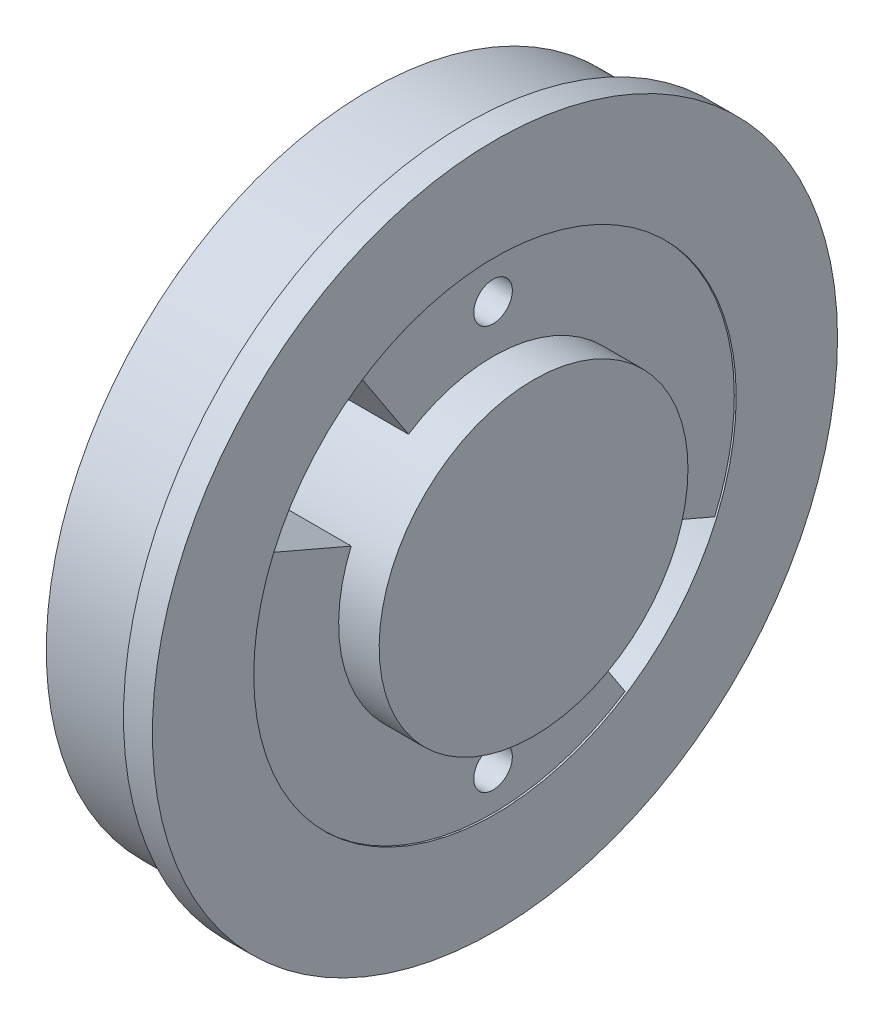
ISO-10303-21;
HEADER;
FILE_DESCRIPTION(('STEP AP214'),'2;1');
FILE_NAME('part.step','',(''),(''),'','','');
FILE_SCHEMA(('AUTOMOTIVE_DESIGN { 1 0 10303 214 1 1 1 1 }'));
ENDSEC;
DATA;
#1=APPLICATION_CONTEXT('core data for automotive mechanical design processes');
#2=APPLICATION_PROTOCOL_DEFINITION('international standard','automotive_design',2000,#1);
#3=PRODUCT_CONTEXT('',#1,'mechanical');
#4=PRODUCT('Part','Part','',(#3));
#5=PRODUCT_RELATED_PRODUCT_CATEGORY('part','',(#4));
#6=PRODUCT_DEFINITION_FORMATION('','',#4);
#7=PRODUCT_DEFINITION_CONTEXT('part definition',#1,'design');
#8=PRODUCT_DEFINITION('design','',#6,#7);
#9=PRODUCT_DEFINITION_SHAPE('','',#8);
#10=(LENGTH_UNIT() NAMED_UNIT(*) SI_UNIT(.MILLI.,.METRE.));
#11=(NAMED_UNIT(*) PLANE_ANGLE_UNIT() SI_UNIT($,.RADIAN.));
#12=(NAMED_UNIT(*) SI_UNIT($,.STERADIAN.) SOLID_ANGLE_UNIT());
#13=UNCERTAINTY_MEASURE_WITH_UNIT(LENGTH_MEASURE(1.E-05),#10,'distance_accuracy_value','');
#14=(GEOMETRIC_REPRESENTATION_CONTEXT(3) GLOBAL_UNCERTAINTY_ASSIGNED_CONTEXT((#13)) GLOBAL_UNIT_ASSIGNED_CONTEXT((#10,
#11,#12)) REPRESENTATION_CONTEXT('',''));
#15=CARTESIAN_POINT('',(0.,0.,0.));
#16=DIRECTION('',(0.,0.,1.));
#17=DIRECTION('',(1.,0.,0.));
#18=AXIS2_PLACEMENT_3D('',#15,#16,#17);
#19=CARTESIAN_POINT('',(6.4,0.,0.));
#20=DIRECTION('',(1.,0.,0.));
#21=DIRECTION('',(0.,0.,-1.));
#22=AXIS2_PLACEMENT_3D('',#19,#20,#21);
#23=CYLINDRICAL_SURFACE('',#22,12.5);
#24=CARTESIAN_POINT('',(6.5,0.,0.));
#25=DIRECTION('',(1.,0.,0.));
#26=DIRECTION('',(0.,0.,-1.));
#27=AXIS2_PLACEMENT_3D('',#24,#25,#26);
#28=CIRCLE('',#27,12.5);
#29=CARTESIAN_POINT('',(6.5,0.,-12.5));
#30=VERTEX_POINT('',#29);
#31=EDGE_CURVE('E150',#30,#30,#28,.T.);
#32=ORIENTED_EDGE('',*,*,#31,.T.);
#33=EDGE_LOOP('',(#32));
#34=FACE_BOUND('',#33,.T.);
#35=CARTESIAN_POINT('',(3.,0.,0.));
#36=DIRECTION('',(-1.,0.,0.));
#37=DIRECTION('',(0.,0.,1.));
#38=AXIS2_PLACEMENT_3D('',#35,#36,#37);
#39=CIRCLE('',#38,12.5);
#40=CARTESIAN_POINT('',(3.,-10.4595444077961,-6.84455482711202));
#41=VERTEX_POINT('',#40);
#42=CARTESIAN_POINT('',(3.,-4.94033364551587,-11.4822952178989));
#43=VERTEX_POINT('',#42);
#44=EDGE_CURVE('E99',#41,#43,#39,.F.);
#45=ORIENTED_EDGE('',*,*,#44,.F.);
#46=DIRECTION('',(1.,0.,0.));
#47=VECTOR('',#46,1.);
#48=CARTESIAN_POINT('',(-21.6,-10.4595444077961,-6.84455482711201));
#49=LINE('',#48,#47);
#50=CARTESIAN_POINT('',(6.4,-10.4595444077961,-6.84455482711201));
#51=VERTEX_POINT('',#50);
#52=EDGE_CURVE('E109',#41,#51,#49,.T.);
#53=ORIENTED_EDGE('',*,*,#52,.T.);
#54=CARTESIAN_POINT('',(6.4,0.,0.));
#55=DIRECTION('',(1.,0.,0.));
#56=DIRECTION('',(0.,0.,-1.));
#57=AXIS2_PLACEMENT_3D('',#54,#55,#56);
#58=CIRCLE('',#57,12.5);
#59=CARTESIAN_POINT('',(6.4,4.94033364551587,11.4822952178989));
#60=VERTEX_POINT('',#59);
#61=EDGE_CURVE('E151',#60,#51,#58,.T.);
#62=ORIENTED_EDGE('',*,*,#61,.F.);
#63=DIRECTION('',(1.,0.,0.));
#64=VECTOR('',#63,1.);
#65=CARTESIAN_POINT('',(-21.6,4.94033364551587,11.4822952178989));
#66=LINE('',#65,#64);
#67=CARTESIAN_POINT('',(3.,4.94033364551587,11.4822952178989));
#68=VERTEX_POINT('',#67);
#69=EDGE_CURVE('E136',#68,#60,#66,.T.);
#70=ORIENTED_EDGE('',*,*,#69,.F.);
#71=CARTESIAN_POINT('',(3.,10.459544407796,6.84455482711202));
#72=VERTEX_POINT('',#71);
#73=EDGE_CURVE('E115',#72,#68,#39,.F.);
#74=ORIENTED_EDGE('',*,*,#73,.F.);
#75=DIRECTION('',(1.,0.,0.));
#76=VECTOR('',#75,1.);
#77=CARTESIAN_POINT('',(-21.6,10.459544407796,6.84455482711202));
#78=LINE('',#77,#76);
#79=CARTESIAN_POINT('',(6.4,10.459544407796,6.84455482711202));
#80=VERTEX_POINT('',#79);
#81=EDGE_CURVE('E138',#72,#80,#78,.T.);
#82=ORIENTED_EDGE('',*,*,#81,.T.);
#83=CARTESIAN_POINT('',(6.4,-4.94033364551587,-11.4822952178989));
#84=VERTEX_POINT('',#83);
#85=EDGE_CURVE('E154',#84,#80,#58,.T.);
#86=ORIENTED_EDGE('',*,*,#85,.F.);
#87=DIRECTION('',(1.,0.,0.));
#88=VECTOR('',#87,1.);
#89=CARTESIAN_POINT('',(-21.6,-4.94033364551587,-11.4822952178989));
#90=LINE('',#89,#88);
#91=EDGE_CURVE('E112',#43,#84,#90,.T.);
#92=ORIENTED_EDGE('',*,*,#91,.F.);
#93=EDGE_LOOP('',(#45,#53,#62,#70,#74,#82,#86,#92));
#94=FACE_BOUND('',#93,.T.);
#95=ADVANCED_FACE('F31',(#34,#94),#23,.F.);
#96=CARTESIAN_POINT('',(8.5,0.,0.));
#97=DIRECTION('',(-1.,0.,0.));
#98=DIRECTION('',(0.,0.,1.));
#99=AXIS2_PLACEMENT_3D('',#96,#97,#98);
#100=CYLINDRICAL_SURFACE('',#99,8.);
#101=CARTESIAN_POINT('',(8.5,0.,0.));
#102=DIRECTION('',(1.,0.,0.));
#103=DIRECTION('',(0.,0.,-1.));
#104=AXIS2_PLACEMENT_3D('',#101,#102,#103);
#105=CIRCLE('',#104,8.);
#106=CARTESIAN_POINT('',(8.5,0.,-8.));
#107=VERTEX_POINT('',#106);
#108=EDGE_CURVE('E153',#107,#107,#105,.T.);
#109=ORIENTED_EDGE('',*,*,#108,.F.);
#110=EDGE_LOOP('',(#109));
#111=FACE_BOUND('',#110,.T.);
#112=CARTESIAN_POINT('',(3.,0.,0.));
#113=DIRECTION('',(-1.,0.,0.));
#114=DIRECTION('',(0.,0.,1.));
#115=AXIS2_PLACEMENT_3D('',#112,#113,#114);
#116=CIRCLE('',#115,8.);
#117=CARTESIAN_POINT('',(3.,3.16181353313016,7.34866893945529));
#118=VERTEX_POINT('',#117);
#119=CARTESIAN_POINT('',(3.,6.69410842098947,4.38051508935169));
#120=VERTEX_POINT('',#119);
#121=EDGE_CURVE('E48',#118,#120,#116,.T.);
#122=ORIENTED_EDGE('',*,*,#121,.F.);
#123=DIRECTION('',(1.,0.,0.));
#124=VECTOR('',#123,1.);
#125=CARTESIAN_POINT('',(-21.6,3.16181353313016,7.34866893945529));
#126=LINE('',#125,#124);
#127=CARTESIAN_POINT('',(6.4,3.16181353313016,7.34866893945529));
#128=VERTEX_POINT('',#127);
#129=EDGE_CURVE('E133',#118,#128,#126,.T.);
#130=ORIENTED_EDGE('',*,*,#129,.T.);
#131=CARTESIAN_POINT('',(6.4,0.,0.));
#132=DIRECTION('',(1.,0.,0.));
#133=DIRECTION('',(0.,0.,-1.));
#134=AXIS2_PLACEMENT_3D('',#131,#132,#133);
#135=CIRCLE('',#134,8.);
#136=CARTESIAN_POINT('',(6.4,-6.69410842098947,-4.38051508935169));
#137=VERTEX_POINT('',#136);
#138=EDGE_CURVE('E147',#128,#137,#135,.T.);
#139=ORIENTED_EDGE('',*,*,#138,.T.);
#140=DIRECTION('',(1.,0.,0.));
#141=VECTOR('',#140,1.);
#142=CARTESIAN_POINT('',(-21.6,-6.69410842098947,-4.38051508935169));
#143=LINE('',#142,#141);
#144=CARTESIAN_POINT('',(3.,-6.69410842098947,-4.38051508935169));
#145=VERTEX_POINT('',#144);
#146=EDGE_CURVE('E120',#145,#137,#143,.T.);
#147=ORIENTED_EDGE('',*,*,#146,.F.);
#148=CARTESIAN_POINT('',(3.,-3.16181353313016,-7.34866893945529));
#149=VERTEX_POINT('',#148);
#150=EDGE_CURVE('E56',#149,#145,#116,.T.);
#151=ORIENTED_EDGE('',*,*,#150,.F.);
#152=DIRECTION('',(1.,0.,0.));
#153=VECTOR('',#152,1.);
#154=CARTESIAN_POINT('',(-21.6,-3.16181353313016,-7.34866893945529));
#155=LINE('',#154,#153);
#156=CARTESIAN_POINT('',(6.4,-3.16181353313016,-7.34866893945529));
#157=VERTEX_POINT('',#156);
#158=EDGE_CURVE('E122',#149,#157,#155,.T.);
#159=ORIENTED_EDGE('',*,*,#158,.T.);
#160=CARTESIAN_POINT('',(6.4,6.69410842098947,4.38051508935169));
#161=VERTEX_POINT('',#160);
#162=EDGE_CURVE('E146',#157,#161,#135,.T.);
#163=ORIENTED_EDGE('',*,*,#162,.T.);
#164=DIRECTION('',(1.,0.,0.));
#165=VECTOR('',#164,1.);
#166=CARTESIAN_POINT('',(-21.6,6.69410842098947,4.38051508935169));
#167=LINE('',#166,#165);
#168=EDGE_CURVE('E132',#120,#161,#167,.T.);
#169=ORIENTED_EDGE('',*,*,#168,.F.);
#170=EDGE_LOOP('',(#122,#130,#139,#147,#151,#159,#163,#169));
#171=FACE_BOUND('',#170,.T.);
#172=ADVANCED_FACE('F181',(#111,#171),#100,.T.);
#173=CARTESIAN_POINT('',(-21.6,4.94033364551587,11.4822952178989));
#174=DIRECTION('',(0.,-0.918583617431912,0.39522669164127));
#175=DIRECTION('',(0.,-0.39522669164127,-0.918583617431912));
#176=AXIS2_PLACEMENT_3D('',#173,#174,#175);
#177=PLANE('',#176);
#178=DIRECTION('',(0.,-0.39522669164127,-0.918583617431912));
#179=VECTOR('',#178,1.);
#180=CARTESIAN_POINT('',(3.,4.94033364551587,11.4822952178989));
#181=LINE('',#180,#179);
#182=EDGE_CURVE('E168',#68,#118,#181,.T.);
#183=ORIENTED_EDGE('',*,*,#182,.F.);
#184=ORIENTED_EDGE('',*,*,#69,.T.);
#185=DIRECTION('',(0.,-0.39522669164127,-0.918583617431912));
#186=VECTOR('',#185,1.);
#187=CARTESIAN_POINT('',(6.4,0.,0.));
#188=LINE('',#187,#186);
#189=EDGE_CURVE('E143',#60,#128,#188,.T.);
#190=ORIENTED_EDGE('',*,*,#189,.T.);
#191=ORIENTED_EDGE('',*,*,#129,.F.);
#192=EDGE_LOOP('',(#183,#184,#190,#191));
#193=FACE_BOUND('',#192,.T.);
#194=ADVANCED_FACE('F197',(#193),#177,.F.);
#195=CARTESIAN_POINT('',(-21.6,6.69410842098947,4.38051508935169));
#196=DIRECTION('',(0.,0.547564386168961,-0.836763552623684));
#197=DIRECTION('',(0.,0.836763552623684,0.547564386168961));
#198=AXIS2_PLACEMENT_3D('',#195,#196,#197);
#199=PLANE('',#198);
#200=DIRECTION('',(0.,0.836763552623684,0.547564386168961));
#201=VECTOR('',#200,1.);
#202=CARTESIAN_POINT('',(3.,6.69410842098947,4.38051508935169));
#203=LINE('',#202,#201);
#204=EDGE_CURVE('E176',#120,#72,#203,.T.);
#205=ORIENTED_EDGE('',*,*,#204,.F.);
#206=ORIENTED_EDGE('',*,*,#168,.T.);
#207=DIRECTION('',(0.,0.836763552623684,0.547564386168961));
#208=VECTOR('',#207,1.);
#209=CARTESIAN_POINT('',(6.4,0.,0.));
#210=LINE('',#209,#208);
#211=EDGE_CURVE('E135',#161,#80,#210,.T.);
#212=ORIENTED_EDGE('',*,*,#211,.T.);
#213=ORIENTED_EDGE('',*,*,#81,.F.);
#214=EDGE_LOOP('',(#205,#206,#212,#213));
#215=FACE_BOUND('',#214,.T.);
#216=ADVANCED_FACE('F193',(#215),#199,.F.);
#217=CARTESIAN_POINT('',(-21.6,-3.16181353313016,-7.34866893945529));
#218=DIRECTION('',(0.,0.918583617431912,-0.39522669164127));
#219=DIRECTION('',(0.,0.39522669164127,0.918583617431912));
#220=AXIS2_PLACEMENT_3D('',#217,#218,#219);
#221=PLANE('',#220);
#222=DIRECTION('',(0.,0.39522669164127,0.918583617431912));
#223=VECTOR('',#222,1.);
#224=CARTESIAN_POINT('',(3.,-3.16181353313016,-7.34866893945529));
#225=LINE('',#224,#223);
#226=EDGE_CURVE('E113',#43,#149,#225,.T.);
#227=ORIENTED_EDGE('',*,*,#226,.F.);
#228=ORIENTED_EDGE('',*,*,#91,.T.);
#229=DIRECTION('',(0.,0.39522669164127,0.918583617431912));
#230=VECTOR('',#229,1.);
#231=CARTESIAN_POINT('',(6.4,0.,0.));
#232=LINE('',#231,#230);
#233=EDGE_CURVE('E129',#84,#157,#232,.T.);
#234=ORIENTED_EDGE('',*,*,#233,.T.);
#235=ORIENTED_EDGE('',*,*,#158,.F.);
#236=EDGE_LOOP('',(#227,#228,#234,#235));
#237=FACE_BOUND('',#236,.T.);
#238=ADVANCED_FACE('F187',(#237),#221,.F.);
#239=CARTESIAN_POINT('',(-21.6,-10.459544407796,-6.84455482711202));
#240=DIRECTION('',(0.,-0.547564386168962,0.836763552623684));
#241=DIRECTION('',(0.,-0.836763552623684,-0.547564386168962));
#242=AXIS2_PLACEMENT_3D('',#239,#240,#241);
#243=PLANE('',#242);
#244=DIRECTION('',(0.,-0.836763552623684,-0.547564386168962));
#245=VECTOR('',#244,1.);
#246=CARTESIAN_POINT('',(3.,-10.459544407796,-6.84455482711202));
#247=LINE('',#246,#245);
#248=EDGE_CURVE('E95',#145,#41,#247,.T.);
#249=ORIENTED_EDGE('',*,*,#248,.F.);
#250=ORIENTED_EDGE('',*,*,#146,.T.);
#251=DIRECTION('',(0.,-0.836763552623684,-0.547564386168962));
#252=VECTOR('',#251,1.);
#253=CARTESIAN_POINT('',(6.4,0.,0.));
#254=LINE('',#253,#252);
#255=EDGE_CURVE('E118',#137,#51,#254,.T.);
#256=ORIENTED_EDGE('',*,*,#255,.T.);
#257=ORIENTED_EDGE('',*,*,#52,.F.);
#258=EDGE_LOOP('',(#249,#250,#256,#257));
#259=FACE_BOUND('',#258,.T.);
#260=ADVANCED_FACE('F116',(#259),#243,.F.);
#261=CARTESIAN_POINT('',(-21.6,10.459544407796,0.));
#262=DIRECTION('',(1.,0.,0.));
#263=DIRECTION('',(0.,0.,-1.));
#264=AXIS2_PLACEMENT_3D('',#261,#262,#263);
#265=CYLINDRICAL_SURFACE('',#264,1.);
#266=CARTESIAN_POINT('',(6.4,10.459544407796,0.));
#267=DIRECTION('',(1.,0.,0.));
#268=DIRECTION('',(0.,0.,-1.));
#269=AXIS2_PLACEMENT_3D('',#266,#267,#268);
#270=CIRCLE('',#269,1.);
#271=CARTESIAN_POINT('',(6.4,10.459544407796,-1.));
#272=VERTEX_POINT('',#271);
#273=EDGE_CURVE('E124',#272,#272,#270,.T.);
#274=ORIENTED_EDGE('',*,*,#273,.T.);
#275=EDGE_LOOP('',(#274));
#276=FACE_BOUND('',#275,.T.);
#277=CARTESIAN_POINT('',(3.,10.459544407796,0.));
#278=DIRECTION('',(-1.,0.,0.));
#279=DIRECTION('',(0.,0.,1.));
#280=AXIS2_PLACEMENT_3D('',#277,#278,#279);
#281=CIRCLE('',#280,1.);
#282=CARTESIAN_POINT('',(3.,10.459544407796,1.));
#283=VERTEX_POINT('',#282);
#284=EDGE_CURVE('E104',#283,#283,#281,.F.);
#285=ORIENTED_EDGE('',*,*,#284,.F.);
#286=EDGE_LOOP('',(#285));
#287=FACE_BOUND('',#286,.T.);
#288=ADVANCED_FACE('F219',(#276,#287),#265,.F.);
#289=CARTESIAN_POINT('',(-21.6,-10.459544407796,0.));
#290=DIRECTION('',(1.,0.,0.));
#291=DIRECTION('',(0.,0.,-1.));
#292=AXIS2_PLACEMENT_3D('',#289,#290,#291);
#293=CYLINDRICAL_SURFACE('',#292,1.);
#294=CARTESIAN_POINT('',(6.4,-10.459544407796,0.));
#295=DIRECTION('',(1.,0.,0.));
#296=DIRECTION('',(0.,0.,-1.));
#297=AXIS2_PLACEMENT_3D('',#294,#295,#296);
#298=CIRCLE('',#297,1.);
#299=CARTESIAN_POINT('',(6.4,-10.459544407796,-1.));
#300=VERTEX_POINT('',#299);
#301=EDGE_CURVE('E166',#300,#300,#298,.T.);
#302=ORIENTED_EDGE('',*,*,#301,.T.);
#303=EDGE_LOOP('',(#302));
#304=FACE_BOUND('',#303,.T.);
#305=CARTESIAN_POINT('',(3.,-10.459544407796,0.));
#306=DIRECTION('',(-1.,0.,0.));
#307=DIRECTION('',(0.,0.,1.));
#308=AXIS2_PLACEMENT_3D('',#305,#306,#307);
#309=CIRCLE('',#308,1.);
#310=CARTESIAN_POINT('',(3.,-10.459544407796,1.));
#311=VERTEX_POINT('',#310);
#312=EDGE_CURVE('E35',#311,#311,#309,.F.);
#313=ORIENTED_EDGE('',*,*,#312,.F.);
#314=EDGE_LOOP('',(#313));
#315=FACE_BOUND('',#314,.T.);
#316=ADVANCED_FACE('F217',(#304,#315),#293,.F.);
#317=CARTESIAN_POINT('',(6.4,0.,0.));
#318=DIRECTION('',(1.,0.,0.));
#319=DIRECTION('',(0.,0.,-1.));
#320=AXIS2_PLACEMENT_3D('',#317,#318,#319);
#321=PLANE('',#320);
#322=ORIENTED_EDGE('',*,*,#273,.F.);
#323=EDGE_LOOP('',(#322));
#324=FACE_BOUND('',#323,.T.);
#325=ORIENTED_EDGE('',*,*,#233,.F.);
#326=ORIENTED_EDGE('',*,*,#85,.T.);
#327=ORIENTED_EDGE('',*,*,#211,.F.);
#328=ORIENTED_EDGE('',*,*,#162,.F.);
#329=EDGE_LOOP('',(#325,#326,#327,#328));
#330=FACE_BOUND('',#329,.T.);
#331=ADVANCED_FACE('F190',(#324,#330),#321,.T.);
#332=CARTESIAN_POINT('',(6.5,0.,0.));
#333=DIRECTION('',(1.,0.,0.));
#334=DIRECTION('',(0.,0.,-1.));
#335=AXIS2_PLACEMENT_3D('',#332,#333,#334);
#336=PLANE('',#335);
#337=ORIENTED_EDGE('',*,*,#31,.F.);
#338=EDGE_LOOP('',(#337));
#339=FACE_BOUND('',#338,.T.);
#340=CARTESIAN_POINT('',(6.5,0.,0.));
#341=DIRECTION('',(1.,0.,0.));
#342=DIRECTION('',(0.,0.,-1.));
#343=AXIS2_PLACEMENT_3D('',#340,#341,#342);
#344=CIRCLE('',#343,17.75);
#345=CARTESIAN_POINT('',(6.5,0.,-17.75));
#346=VERTEX_POINT('',#345);
#347=EDGE_CURVE('E160',#346,#346,#344,.T.);
#348=ORIENTED_EDGE('',*,*,#347,.T.);
#349=EDGE_LOOP('',(#348));
#350=FACE_BOUND('',#349,.T.);
#351=ADVANCED_FACE('F225',(#339,#350),#336,.T.);
#352=CARTESIAN_POINT('',(5.,0.,0.));
#353=DIRECTION('',(-1.,0.,0.));
#354=DIRECTION('',(0.,0.,1.));
#355=AXIS2_PLACEMENT_3D('',#352,#353,#354);
#356=CYLINDRICAL_SURFACE('',#355,16.75);
#357=CARTESIAN_POINT('',(5.,0.,0.));
#358=DIRECTION('',(1.,0.,0.));
#359=DIRECTION('',(0.,0.,-1.));
#360=AXIS2_PLACEMENT_3D('',#357,#358,#359);
#361=CIRCLE('',#360,16.75);
#362=CARTESIAN_POINT('',(5.,0.,-16.75));
#363=VERTEX_POINT('',#362);
#364=EDGE_CURVE('E11',#363,#363,#361,.T.);
#365=ORIENTED_EDGE('',*,*,#364,.F.);
#366=EDGE_LOOP('',(#365));
#367=FACE_BOUND('',#366,.T.);
#368=CARTESIAN_POINT('',(0.,0.,0.));
#369=DIRECTION('',(1.,0.,0.));
#370=DIRECTION('',(0.,0.,-1.));
#371=AXIS2_PLACEMENT_3D('',#368,#369,#370);
#372=CIRCLE('',#371,16.75);
#373=CARTESIAN_POINT('',(0.,0.,-16.75));
#374=VERTEX_POINT('',#373);
#375=EDGE_CURVE('E40',#374,#374,#372,.T.);
#376=ORIENTED_EDGE('',*,*,#375,.T.);
#377=EDGE_LOOP('',(#376));
#378=FACE_BOUND('',#377,.T.);
#379=ADVANCED_FACE('F33',(#367,#378),#356,.T.);
#380=CARTESIAN_POINT('',(0.,0.,0.));
#381=DIRECTION('',(1.,0.,0.));
#382=DIRECTION('',(0.,0.,-1.));
#383=AXIS2_PLACEMENT_3D('',#380,#381,#382);
#384=PLANE('',#383);
#385=CARTESIAN_POINT('',(0.,0.,0.));
#386=DIRECTION('',(-1.,0.,0.));
#387=DIRECTION('',(0.,0.,1.));
#388=AXIS2_PLACEMENT_3D('',#385,#386,#387);
#389=CIRCLE('',#388,14.75);
#390=CARTESIAN_POINT('',(0.,0.,14.75));
#391=VERTEX_POINT('',#390);
#392=EDGE_CURVE('E207',#391,#391,#389,.T.);
#393=ORIENTED_EDGE('',*,*,#392,.F.);
#394=EDGE_LOOP('',(#393));
#395=FACE_BOUND('',#394,.T.);
#396=ORIENTED_EDGE('',*,*,#375,.F.);
#397=EDGE_LOOP('',(#396));
#398=FACE_BOUND('',#397,.T.);
#399=ADVANCED_FACE('F252',(#395,#398),#384,.F.);
#400=CARTESIAN_POINT('',(5.,0.,0.));
#401=DIRECTION('',(1.,0.,0.));
#402=DIRECTION('',(0.,0.,-1.));
#403=AXIS2_PLACEMENT_3D('',#400,#401,#402);
#404=PLANE('',#403);
#405=CARTESIAN_POINT('',(5.,0.,0.));
#406=DIRECTION('',(1.,0.,0.));
#407=DIRECTION('',(0.,0.,-1.));
#408=AXIS2_PLACEMENT_3D('',#405,#406,#407);
#409=CIRCLE('',#408,17.75);
#410=CARTESIAN_POINT('',(5.,0.,-17.75));
#411=VERTEX_POINT('',#410);
#412=EDGE_CURVE('E159',#411,#411,#409,.T.);
#413=ORIENTED_EDGE('',*,*,#412,.F.);
#414=EDGE_LOOP('',(#413));
#415=FACE_BOUND('',#414,.T.);
#416=ORIENTED_EDGE('',*,*,#364,.T.);
#417=EDGE_LOOP('',(#416));
#418=FACE_BOUND('',#417,.T.);
#419=ADVANCED_FACE('F248',(#415,#418),#404,.F.);
#420=CARTESIAN_POINT('',(6.5,0.,0.));
#421=DIRECTION('',(-1.,0.,0.));
#422=DIRECTION('',(0.,0.,1.));
#423=AXIS2_PLACEMENT_3D('',#420,#421,#422);
#424=CYLINDRICAL_SURFACE('',#423,17.75);
#425=ORIENTED_EDGE('',*,*,#347,.F.);
#426=EDGE_LOOP('',(#425));
#427=FACE_BOUND('',#426,.T.);
#428=ORIENTED_EDGE('',*,*,#412,.T.);
#429=EDGE_LOOP('',(#428));
#430=FACE_BOUND('',#429,.T.);
#431=ADVANCED_FACE('F251',(#427,#430),#424,.T.);
#432=ORIENTED_EDGE('',*,*,#301,.F.);
#433=EDGE_LOOP('',(#432));
#434=FACE_BOUND('',#433,.T.);
#435=ORIENTED_EDGE('',*,*,#255,.F.);
#436=ORIENTED_EDGE('',*,*,#138,.F.);
#437=ORIENTED_EDGE('',*,*,#189,.F.);
#438=ORIENTED_EDGE('',*,*,#61,.T.);
#439=EDGE_LOOP('',(#435,#436,#437,#438));
#440=FACE_BOUND('',#439,.T.);
#441=ADVANCED_FACE('F202',(#434,#440),#321,.T.);
#442=CARTESIAN_POINT('',(8.5,0.,0.));
#443=DIRECTION('',(1.,0.,0.));
#444=DIRECTION('',(0.,0.,-1.));
#445=AXIS2_PLACEMENT_3D('',#442,#443,#444);
#446=PLANE('',#445);
#447=ORIENTED_EDGE('',*,*,#108,.T.);
#448=EDGE_LOOP('',(#447));
#449=FACE_BOUND('',#448,.T.);
#450=ADVANCED_FACE('F241',(#449),#446,.T.);
#451=CARTESIAN_POINT('',(3.,0.,0.));
#452=DIRECTION('',(-1.,0.,0.));
#453=DIRECTION('',(0.,0.,1.));
#454=AXIS2_PLACEMENT_3D('',#451,#452,#453);
#455=PLANE('',#454);
#456=ORIENTED_EDGE('',*,*,#226,.T.);
#457=ORIENTED_EDGE('',*,*,#150,.T.);
#458=ORIENTED_EDGE('',*,*,#248,.T.);
#459=ORIENTED_EDGE('',*,*,#44,.T.);
#460=EDGE_LOOP('',(#456,#457,#458,#459));
#461=FACE_BOUND('',#460,.T.);
#462=ORIENTED_EDGE('',*,*,#312,.T.);
#463=EDGE_LOOP('',(#462));
#464=FACE_BOUND('',#463,.T.);
#465=CARTESIAN_POINT('',(3.,0.,0.));
#466=DIRECTION('',(-1.,0.,0.));
#467=DIRECTION('',(0.,0.,1.));
#468=AXIS2_PLACEMENT_3D('',#465,#466,#467);
#469=CIRCLE('',#468,14.75);
#470=CARTESIAN_POINT('',(3.,0.,14.75));
#471=VERTEX_POINT('',#470);
#472=EDGE_CURVE('E210',#471,#471,#469,.T.);
#473=ORIENTED_EDGE('',*,*,#472,.T.);
#474=EDGE_LOOP('',(#473));
#475=FACE_BOUND('',#474,.T.);
#476=ORIENTED_EDGE('',*,*,#284,.T.);
#477=EDGE_LOOP('',(#476));
#478=FACE_BOUND('',#477,.T.);
#479=ORIENTED_EDGE('',*,*,#182,.T.);
#480=ORIENTED_EDGE('',*,*,#121,.T.);
#481=ORIENTED_EDGE('',*,*,#204,.T.);
#482=ORIENTED_EDGE('',*,*,#73,.T.);
#483=EDGE_LOOP('',(#479,#480,#481,#482));
#484=FACE_BOUND('',#483,.T.);
#485=ADVANCED_FACE('F97',(#461,#464,#475,#478,#484),#455,.T.);
#486=CARTESIAN_POINT('',(3.,0.,0.));
#487=DIRECTION('',(-1.,0.,0.));
#488=DIRECTION('',(0.,0.,1.));
#489=AXIS2_PLACEMENT_3D('',#486,#487,#488);
#490=CYLINDRICAL_SURFACE('',#489,14.75);
#491=ORIENTED_EDGE('',*,*,#472,.F.);
#492=EDGE_LOOP('',(#491));
#493=FACE_BOUND('',#492,.T.);
#494=ORIENTED_EDGE('',*,*,#392,.T.);
#495=EDGE_LOOP('',(#494));
#496=FACE_BOUND('',#495,.T.);
#497=ADVANCED_FACE('F267',(#493,#496),#490,.F.);
#498=CLOSED_SHELL('',(#95,#172,#194,#216,#238,#260,#288,#316,#331,#351,#379,#399,#419,#431,#441,
#450,#485,#497));
#499=MANIFOLD_SOLID_BREP('B2',#498);
#500=ADVANCED_BREP_SHAPE_REPRESENTATION('',(#18,#499),#14);
#501=SHAPE_DEFINITION_REPRESENTATION(#9,#500);
ENDSEC;
END-ISO-10303-21;
